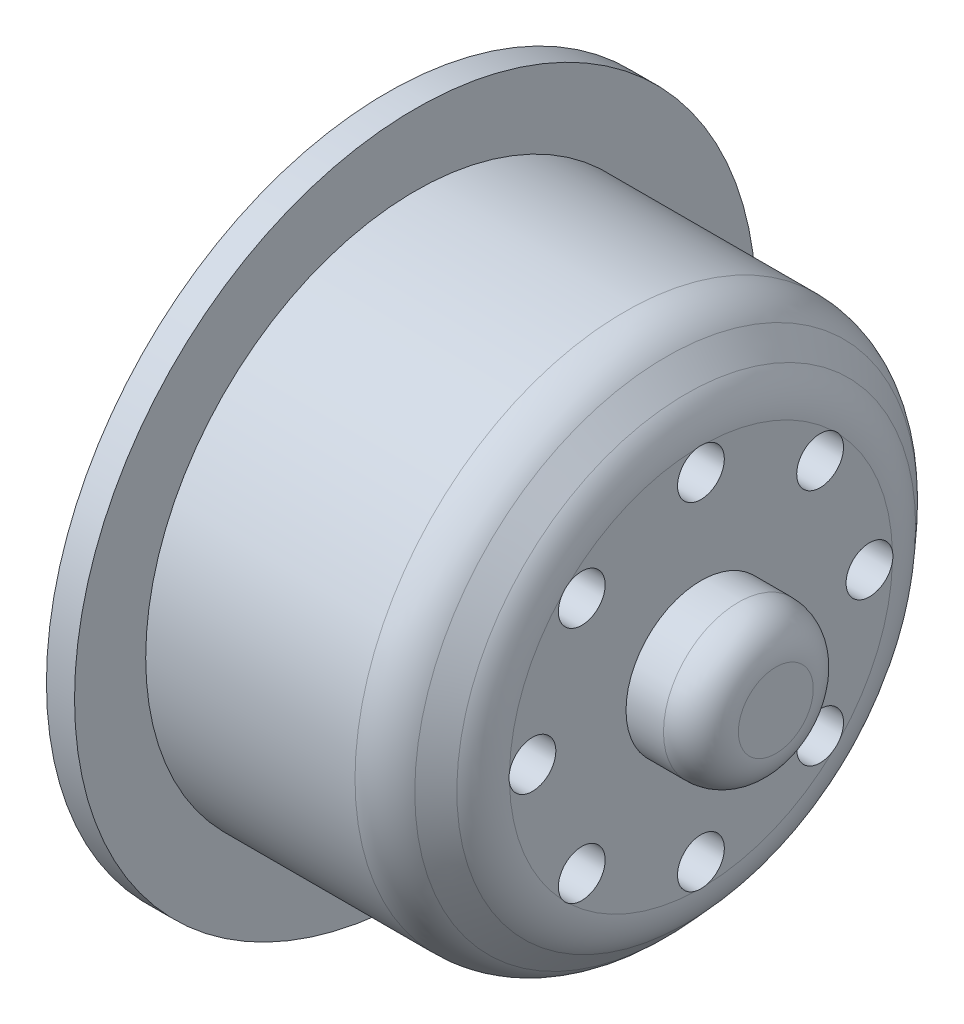
ISO-10303-21;
HEADER;
FILE_DESCRIPTION(('STEP AP214'),'2;1');
FILE_NAME('part.step','',(''),(''),'','','');
FILE_SCHEMA(('AUTOMOTIVE_DESIGN { 1 0 10303 214 1 1 1 1 }'));
ENDSEC;
DATA;
#1=APPLICATION_CONTEXT('core data for automotive mechanical design processes');
#2=APPLICATION_PROTOCOL_DEFINITION('international standard','automotive_design',2000,#1);
#3=PRODUCT_CONTEXT('',#1,'mechanical');
#4=PRODUCT('Part','Part','',(#3));
#5=PRODUCT_RELATED_PRODUCT_CATEGORY('part','',(#4));
#6=PRODUCT_DEFINITION_FORMATION('','',#4);
#7=PRODUCT_DEFINITION_CONTEXT('part definition',#1,'design');
#8=PRODUCT_DEFINITION('design','',#6,#7);
#9=PRODUCT_DEFINITION_SHAPE('','',#8);
#10=(LENGTH_UNIT() NAMED_UNIT(*) SI_UNIT(.MILLI.,.METRE.));
#11=(NAMED_UNIT(*) PLANE_ANGLE_UNIT() SI_UNIT($,.RADIAN.));
#12=(NAMED_UNIT(*) SI_UNIT($,.STERADIAN.) SOLID_ANGLE_UNIT());
#13=UNCERTAINTY_MEASURE_WITH_UNIT(LENGTH_MEASURE(1.E-05),#10,'distance_accuracy_value','');
#14=(GEOMETRIC_REPRESENTATION_CONTEXT(3) GLOBAL_UNCERTAINTY_ASSIGNED_CONTEXT((#13)) GLOBAL_UNIT_ASSIGNED_CONTEXT((#10,
#11,#12)) REPRESENTATION_CONTEXT('',''));
#15=CARTESIAN_POINT('',(0.,0.,0.));
#16=DIRECTION('',(0.,0.,1.));
#17=DIRECTION('',(1.,0.,0.));
#18=AXIS2_PLACEMENT_3D('',#15,#16,#17);
#19=CARTESIAN_POINT('',(-9.66596868854574,6.36396103067838,6.3639610306787));
#20=DIRECTION('',(1.,0.,0.));
#21=DIRECTION('',(0.,0.,-1.));
#22=AXIS2_PLACEMENT_3D('',#19,#20,#21);
#23=CYLINDRICAL_SURFACE('',#22,1.25000000000048);
#24=CARTESIAN_POINT('',(10.6195652173913,6.36396103067838,6.3639610306787));
#25=DIRECTION('',(1.,0.,0.));
#26=DIRECTION('',(0.,0.,-1.));
#27=AXIS2_PLACEMENT_3D('',#24,#25,#26);
#28=CIRCLE('',#27,1.25000000000048);
#29=CARTESIAN_POINT('',(10.6195652173913,7.04596741641522,7.41151403163636));
#30=VERTEX_POINT('',#29);
#31=CARTESIAN_POINT('',(10.6195652173913,7.411514031636,7.04596741641559));
#32=VERTEX_POINT('',#31);
#33=EDGE_CURVE('E147',#30,#32,#28,.T.);
#34=ORIENTED_EDGE('',*,*,#33,.T.);
#35=CARTESIAN_POINT('',(10.6195652173913,7.411514031636,7.04596741641559));
#36=CARTESIAN_POINT('',(10.6195631780049,7.3921665441352,7.07568123261779));
#37=CARTESIAN_POINT('',(10.6195450792208,7.37156780283131,7.10455609710923));
#38=CARTESIAN_POINT('',(10.6195060472776,7.32798836855858,7.16046028078622));
#39=CARTESIAN_POINT('',(10.6194851133993,7.30500707156565,7.18748912907579));
#40=CARTESIAN_POINT('',(10.6194623135887,7.23356505711365,7.26458438701048));
#41=CARTESIAN_POINT('',(10.6194982553825,7.18188988291681,7.31175467629777));
#42=CARTESIAN_POINT('',(10.6195444906783,7.10055561788832,7.37442318921318));
#43=CARTESIAN_POINT('',(10.6195583321452,7.07361016905411,7.3935317962861));
#44=CARTESIAN_POINT('',(10.6195652173913,7.04596741641522,7.41151403163636));
#45=B_SPLINE_CURVE_WITH_KNOTS('',3,(#35,#36,#37,#38,#39,#40,#41,#42,#43,#44),.UNSPECIFIED.,.F.,
.F.,(4,2,2,2,4),(0.,0.106299940745221,0.212626896795299,0.421403751994226,0.520384501001311),.UNSPECIFIED.);
#46=EDGE_CURVE('E53',#32,#30,#45,.T.);
#47=ORIENTED_EDGE('',*,*,#46,.T.);
#48=EDGE_LOOP('',(#34,#47));
#49=FACE_BOUND('',#48,.T.);
#50=CARTESIAN_POINT('',(5.61956521739131,6.36396103067838,6.3639610306787));
#51=DIRECTION('',(-1.,0.,0.));
#52=DIRECTION('',(0.,0.,1.));
#53=AXIS2_PLACEMENT_3D('',#50,#51,#52);
#54=CIRCLE('',#53,1.25000000000048);
#55=CARTESIAN_POINT('',(5.61956521739131,6.36396103067838,7.61396103067918));
#56=VERTEX_POINT('',#55);
#57=EDGE_CURVE('E149',#56,#56,#54,.F.);
#58=ORIENTED_EDGE('',*,*,#57,.F.);
#59=EDGE_LOOP('',(#58));
#60=FACE_BOUND('',#59,.T.);
#61=ADVANCED_FACE('F39',(#49,#60),#23,.F.);
#62=CARTESIAN_POINT('',(-9.66596868854574,-7.66835063561292E-13,8.99999999999923));
#63=DIRECTION('',(1.,0.,0.));
#64=DIRECTION('',(0.,0.,-1.));
#65=AXIS2_PLACEMENT_3D('',#62,#63,#64);
#66=CYLINDRICAL_SURFACE('',#65,1.25000000000105);
#67=CARTESIAN_POINT('',(10.6195652173913,-7.66835063561292E-13,8.99999999999923));
#68=DIRECTION('',(1.,0.,0.));
#69=DIRECTION('',(0.,0.,-1.));
#70=AXIS2_PLACEMENT_3D('',#67,#68,#69);
#71=CIRCLE('',#70,1.25000000000105);
#72=CARTESIAN_POINT('',(10.6195652173913,-0.258480490465189,10.2229831707959));
#73=VERTEX_POINT('',#72);
#74=CARTESIAN_POINT('',(10.6195652173913,0.258480490463447,10.222983170796));
#75=VERTEX_POINT('',#74);
#76=EDGE_CURVE('E144',#73,#75,#71,.T.);
#77=ORIENTED_EDGE('',*,*,#76,.T.);
#78=CARTESIAN_POINT('',(10.6195652173913,0.258480490463447,10.222983170796));
#79=CARTESIAN_POINT('',(10.6195631780049,0.223788909921195,10.2303132721168));
#80=CARTESIAN_POINT('',(10.6195450792208,0.188805787773558,10.2361653749447));
#81=CARTESIAN_POINT('',(10.6195060472776,0.118460246904311,10.244880288825));
#82=CARTESIAN_POINT('',(10.6194851133993,0.0830977340469196,10.2477423397941));
#83=CARTESIAN_POINT('',(10.6194623135887,-0.021933978516702,10.2517397865965));
#84=CARTESIAN_POINT('',(10.6194982553825,-0.0918282760358895,10.2485543519286));
#85=CARTESIAN_POINT('',(10.6195444906783,-0.193653616830998,10.2353556720335));
#86=CARTESIAN_POINT('',(10.6195583321452,-0.226218752065304,10.2298141880808));
#87=CARTESIAN_POINT('',(10.6195652173913,-0.258480490465189,10.2229831707959));
#88=B_SPLINE_CURVE_WITH_KNOTS('',3,(#78,#79,#80,#81,#82,#83,#84,#85,#86,#87),.UNSPECIFIED.,.F.,
.F.,(4,2,2,2,4),(0.,0.106299940745276,0.212626896795408,0.421403751994417,0.520384501005222),.UNSPECIFIED.);
#89=EDGE_CURVE('E285',#75,#73,#88,.T.);
#90=ORIENTED_EDGE('',*,*,#89,.T.);
#91=EDGE_LOOP('',(#77,#90));
#92=FACE_BOUND('',#91,.T.);
#93=CARTESIAN_POINT('',(5.61956521739131,-7.66835063561292E-13,8.99999999999923));
#94=DIRECTION('',(-1.,0.,0.));
#95=DIRECTION('',(0.,0.,1.));
#96=AXIS2_PLACEMENT_3D('',#93,#94,#95);
#97=CIRCLE('',#96,1.25000000000105);
#98=CARTESIAN_POINT('',(5.61956521739131,-7.66835063561292E-13,10.2500000000003));
#99=VERTEX_POINT('',#98);
#100=EDGE_CURVE('E189',#99,#99,#97,.F.);
#101=ORIENTED_EDGE('',*,*,#100,.F.);
#102=EDGE_LOOP('',(#101));
#103=FACE_BOUND('',#102,.T.);
#104=ADVANCED_FACE('F277',(#92,#103),#66,.F.);
#105=CARTESIAN_POINT('',(-9.66596868854574,-6.36396103067947,6.36396103067762));
#106=DIRECTION('',(1.,0.,0.));
#107=DIRECTION('',(0.,0.,-1.));
#108=AXIS2_PLACEMENT_3D('',#105,#106,#107);
#109=CYLINDRICAL_SURFACE('',#108,1.25000000000148);
#110=CARTESIAN_POINT('',(10.6195652173913,-6.36396103067947,6.36396103067762));
#111=DIRECTION('',(1.,0.,0.));
#112=DIRECTION('',(0.,0.,-1.));
#113=AXIS2_PLACEMENT_3D('',#110,#111,#112);
#114=CIRCLE('',#113,1.25000000000148);
#115=CARTESIAN_POINT('',(10.6195652173913,-7.41151403164101,7.04596741641032));
#116=VERTEX_POINT('',#115);
#117=CARTESIAN_POINT('',(10.6195652173913,-7.04596741641248,7.41151403163896));
#118=VERTEX_POINT('',#117);
#119=EDGE_CURVE('E141',#116,#118,#114,.T.);
#120=ORIENTED_EDGE('',*,*,#119,.T.);
#121=CARTESIAN_POINT('',(10.6195652173913,-7.04596741641248,7.41151403163896));
#122=CARTESIAN_POINT('',(10.6195631780049,-7.07568123261479,7.39216654413827));
#123=CARTESIAN_POINT('',(10.6195450792208,-7.10455609710634,7.37156780283448));
#124=CARTESIAN_POINT('',(10.6195060472776,-7.16046028078358,7.32798836856194));
#125=CARTESIAN_POINT('',(10.6194851133993,-7.18748912907327,7.3050070715691));
#126=CARTESIAN_POINT('',(10.6194623135887,-7.26458438700831,7.23356505711737));
#127=CARTESIAN_POINT('',(10.6194982553825,-7.31175467629584,7.1818898829207));
#128=CARTESIAN_POINT('',(10.6195444906783,-7.37442318921385,7.10055561788955));
#129=CARTESIAN_POINT('',(10.6195583321452,-7.39353179628889,7.07361016905235));
#130=CARTESIAN_POINT('',(10.6195652173913,-7.41151403164101,7.04596741641032));
#131=B_SPLINE_CURVE_WITH_KNOTS('',3,(#121,#122,#123,#124,#125,#126,#127,#128,#129,#130),
.UNSPECIFIED.,.F.,.F.,(4,2,2,2,4),(0.,0.106299940745328,0.212626896795508,0.421403751994564,
0.520384501012581),.UNSPECIFIED.);
#132=EDGE_CURVE('E280',#118,#116,#131,.T.);
#133=ORIENTED_EDGE('',*,*,#132,.T.);
#134=EDGE_LOOP('',(#120,#133));
#135=FACE_BOUND('',#134,.T.);
#136=CARTESIAN_POINT('',(5.61956521739131,-6.36396103067947,6.36396103067762));
#137=DIRECTION('',(-1.,0.,0.));
#138=DIRECTION('',(0.,0.,1.));
#139=AXIS2_PLACEMENT_3D('',#136,#137,#138);
#140=CIRCLE('',#139,1.25000000000148);
#141=CARTESIAN_POINT('',(5.61956521739131,-6.36396103067947,7.6139610306791));
#142=VERTEX_POINT('',#141);
#143=EDGE_CURVE('E186',#142,#142,#140,.F.);
#144=ORIENTED_EDGE('',*,*,#143,.F.);
#145=EDGE_LOOP('',(#144));
#146=FACE_BOUND('',#145,.T.);
#147=ADVANCED_FACE('F272',(#135,#146),#109,.F.);
#148=CARTESIAN_POINT('',(-9.66596868854574,-9.,-1.53146576288412E-12));
#149=DIRECTION('',(1.,0.,0.));
#150=DIRECTION('',(0.,0.,-1.));
#151=AXIS2_PLACEMENT_3D('',#148,#149,#150);
#152=CYLINDRICAL_SURFACE('',#151,1.25000000000152);
#153=CARTESIAN_POINT('',(10.6195652173913,-9.,-1.53146576288412E-12));
#154=DIRECTION('',(1.,0.,0.));
#155=DIRECTION('',(0.,0.,-1.));
#156=AXIS2_PLACEMENT_3D('',#153,#154,#155);
#157=CIRCLE('',#156,1.25000000000152);
#158=CARTESIAN_POINT('',(10.6195652173913,-10.2229831707957,-0.258480490472793));
#159=VERTEX_POINT('',#158);
#160=CARTESIAN_POINT('',(10.6195652173913,-10.2229831707958,0.258480490469314));
#161=VERTEX_POINT('',#160);
#162=EDGE_CURVE('E138',#159,#161,#157,.T.);
#163=ORIENTED_EDGE('',*,*,#162,.T.);
#164=CARTESIAN_POINT('',(10.6195652173913,-10.2229831707958,0.258480490469314));
#165=CARTESIAN_POINT('',(10.6195631780049,-10.2303132721168,0.223788909927081));
#166=CARTESIAN_POINT('',(10.6195450792208,-10.2361653749449,0.188805787779453));
#167=CARTESIAN_POINT('',(10.6195060472776,-10.2448802888256,0.118460246910208));
#168=CARTESIAN_POINT('',(10.6194851133993,-10.2477423397949,0.0830977340528114));
#169=CARTESIAN_POINT('',(10.6194623135887,-10.2517397865979,-0.0219339785108185));
#170=CARTESIAN_POINT('',(10.6194982553825,-10.2485543519303,-0.0918282760300287));
#171=CARTESIAN_POINT('',(10.6195444906783,-10.2353556720352,-0.193653616829725));
#172=CARTESIAN_POINT('',(10.6195583321452,-10.2298141880817,-0.226218752068514));
#173=CARTESIAN_POINT('',(10.6195652173913,-10.2229831707957,-0.258480490472793));
#174=B_SPLINE_CURVE_WITH_KNOTS('',3,(#164,#165,#166,#167,#168,#169,#170,#171,#172,#173),
.UNSPECIFIED.,.F.,.F.,(4,2,2,2,4),(0.,0.106299940745344,0.212626896795537,0.421403751994579,
0.520384501018977),.UNSPECIFIED.);
#175=EDGE_CURVE('E257',#161,#159,#174,.T.);
#176=ORIENTED_EDGE('',*,*,#175,.T.);
#177=EDGE_LOOP('',(#163,#176));
#178=FACE_BOUND('',#177,.T.);
#179=CARTESIAN_POINT('',(5.61956521739131,-9.,-1.53146576288412E-12));
#180=DIRECTION('',(-1.,0.,0.));
#181=DIRECTION('',(0.,0.,1.));
#182=AXIS2_PLACEMENT_3D('',#179,#180,#181);
#183=CIRCLE('',#182,1.25000000000152);
#184=CARTESIAN_POINT('',(5.61956521739131,-9.,1.24999999999999));
#185=VERTEX_POINT('',#184);
#186=EDGE_CURVE('E183',#185,#185,#183,.F.);
#187=ORIENTED_EDGE('',*,*,#186,.F.);
#188=EDGE_LOOP('',(#187));
#189=FACE_BOUND('',#188,.T.);
#190=ADVANCED_FACE('F267',(#178,#189),#152,.F.);
#191=CARTESIAN_POINT('',(-9.66596868854574,-6.36396103067839,-6.36396103068023));
#192=DIRECTION('',(1.,0.,0.));
#193=DIRECTION('',(0.,0.,-1.));
#194=AXIS2_PLACEMENT_3D('',#191,#192,#193);
#195=CYLINDRICAL_SURFACE('',#194,1.25000000000114);
#196=CARTESIAN_POINT('',(10.6195652173913,-6.36396103067839,-6.36396103068023));
#197=DIRECTION('',(1.,0.,0.));
#198=DIRECTION('',(0.,0.,-1.));
#199=AXIS2_PLACEMENT_3D('',#196,#197,#198);
#200=CIRCLE('',#199,1.25000000000114);
#201=CARTESIAN_POINT('',(10.6195652173913,-7.04596741640749,-7.4115140316437));
#202=VERTEX_POINT('',#201);
#203=CARTESIAN_POINT('',(10.6195652173913,-7.41151403164166,-7.04596741640964));
#204=VERTEX_POINT('',#203);
#205=EDGE_CURVE('E135',#202,#204,#200,.T.);
#206=ORIENTED_EDGE('',*,*,#205,.T.);
#207=CARTESIAN_POINT('',(10.6195652173913,-7.41151403164166,-7.04596741640964));
#208=CARTESIAN_POINT('',(10.6195631780049,-7.39216654414107,-7.07568123261201));
#209=CARTESIAN_POINT('',(10.6195450792208,-7.37156780283737,-7.10455609710363));
#210=CARTESIAN_POINT('',(10.6195060472776,-7.32798836856502,-7.160460280781));
#211=CARTESIAN_POINT('',(10.6194851133993,-7.30500707157227,-7.18748912907076));
#212=CARTESIAN_POINT('',(10.6194623135887,-7.23356505712082,-7.26458438700601));
#213=CARTESIAN_POINT('',(10.6194982553825,-7.18188988292432,-7.31175467629368));
#214=CARTESIAN_POINT('',(10.6195444906783,-7.10055561789125,-7.3744231892136));
#215=CARTESIAN_POINT('',(10.6195583321452,-7.07361016905184,-7.3935317962902));
#216=CARTESIAN_POINT('',(10.6195652173913,-7.04596741640749,-7.4115140316437));
#217=B_SPLINE_CURVE_WITH_KNOTS('',3,(#207,#208,#209,#210,#211,#212,#213,#214,#215,#216),
.UNSPECIFIED.,.F.,.F.,(4,2,2,2,4),(0.,0.106299940745316,0.212626896795477,0.421403751994447,
0.520384501020571),.UNSPECIFIED.);
#218=EDGE_CURVE('E251',#204,#202,#217,.T.);
#219=ORIENTED_EDGE('',*,*,#218,.T.);
#220=EDGE_LOOP('',(#206,#219));
#221=FACE_BOUND('',#220,.T.);
#222=CARTESIAN_POINT('',(5.61956521739131,-6.36396103067839,-6.36396103068023));
#223=DIRECTION('',(-1.,0.,0.));
#224=DIRECTION('',(0.,0.,1.));
#225=AXIS2_PLACEMENT_3D('',#222,#223,#224);
#226=CIRCLE('',#225,1.25000000000114);
#227=CARTESIAN_POINT('',(5.61956521739131,-6.36396103067839,-5.1139610306791));
#228=VERTEX_POINT('',#227);
#229=EDGE_CURVE('E180',#228,#228,#226,.F.);
#230=ORIENTED_EDGE('',*,*,#229,.F.);
#231=EDGE_LOOP('',(#230));
#232=FACE_BOUND('',#231,.T.);
#233=ADVANCED_FACE('F264',(#221,#232),#195,.F.);
#234=CARTESIAN_POINT('',(-9.66596868854574,7.65732881442059E-13,-9.00000000000076));
#235=DIRECTION('',(1.,0.,0.));
#236=DIRECTION('',(0.,0.,-1.));
#237=AXIS2_PLACEMENT_3D('',#234,#235,#236);
#238=CYLINDRICAL_SURFACE('',#237,1.25000000000054);
#239=CARTESIAN_POINT('',(10.6195652173913,7.65732881442059E-13,-9.00000000000076));
#240=DIRECTION('',(1.,0.,0.));
#241=DIRECTION('',(0.,0.,-1.));
#242=AXIS2_PLACEMENT_3D('',#239,#240,#241);
#243=CIRCLE('',#242,1.25000000000054);
#244=CARTESIAN_POINT('',(10.6195652173913,0.258480490470619,-10.2229831707958));
#245=VERTEX_POINT('',#244);
#246=CARTESIAN_POINT('',(10.6195652173913,-0.258480490468879,-10.2229831707958));
#247=VERTEX_POINT('',#246);
#248=EDGE_CURVE('E127',#245,#247,#243,.T.);
#249=ORIENTED_EDGE('',*,*,#248,.T.);
#250=CARTESIAN_POINT('',(10.6195652173913,-0.258480490468879,-10.2229831707958));
#251=CARTESIAN_POINT('',(10.6195631780049,-0.223788909926669,-10.2303132721168));
#252=CARTESIAN_POINT('',(10.6195450792208,-0.188805787779065,-10.2361653749449));
#253=CARTESIAN_POINT('',(10.6195060472776,-0.118460246909872,-10.2448802888255));
#254=CARTESIAN_POINT('',(10.6194851133993,-0.0830977340525016,-10.2477423397947));
#255=CARTESIAN_POINT('',(10.6194623135887,0.0219339785110503,-10.2517397865976));
#256=CARTESIAN_POINT('',(10.6194982553825,0.0918282760302062,-10.24855435193));
#257=CARTESIAN_POINT('',(10.6195444906783,0.193653616829069,-10.2353556720349));
#258=CARTESIAN_POINT('',(10.6195583321452,0.226218752067091,-10.2298141880816));
#259=CARTESIAN_POINT('',(10.6195652173913,0.258480490470619,-10.2229831707958));
#260=B_SPLINE_CURVE_WITH_KNOTS('',3,(#250,#251,#252,#253,#254,#255,#256,#257,#258,#259),
.UNSPECIFIED.,.F.,.F.,(4,2,2,2,4),(0.,0.106299940745255,0.212626896795361,0.421403751994246,
0.520384501016319),.UNSPECIFIED.);
#261=EDGE_CURVE('E245',#247,#245,#260,.T.);
#262=ORIENTED_EDGE('',*,*,#261,.T.);
#263=EDGE_LOOP('',(#249,#262));
#264=FACE_BOUND('',#263,.T.);
#265=CARTESIAN_POINT('',(5.61956521739131,7.65732881442059E-13,-9.00000000000076));
#266=DIRECTION('',(-1.,0.,0.));
#267=DIRECTION('',(0.,0.,1.));
#268=AXIS2_PLACEMENT_3D('',#265,#266,#267);
#269=CIRCLE('',#268,1.25000000000054);
#270=CARTESIAN_POINT('',(5.61956521739131,7.65732881442059E-13,-7.75000000000023));
#271=VERTEX_POINT('',#270);
#272=EDGE_CURVE('E177',#271,#271,#269,.F.);
#273=ORIENTED_EDGE('',*,*,#272,.F.);
#274=EDGE_LOOP('',(#273));
#275=FACE_BOUND('',#274,.T.);
#276=ADVANCED_FACE('F236',(#264,#275),#238,.F.);
#277=CARTESIAN_POINT('',(-9.66596868854574,6.36396103067947,-6.36396103067915));
#278=DIRECTION('',(1.,0.,0.));
#279=DIRECTION('',(0.,0.,-1.));
#280=AXIS2_PLACEMENT_3D('',#277,#278,#279);
#281=CYLINDRICAL_SURFACE('',#280,1.25000000000007);
#282=CARTESIAN_POINT('',(10.6195652173913,6.36396103067947,-6.36396103067915));
#283=DIRECTION('',(1.,0.,0.));
#284=DIRECTION('',(0.,0.,-1.));
#285=AXIS2_PLACEMENT_3D('',#282,#283,#284);
#286=CIRCLE('',#285,1.25000000000007);
#287=CARTESIAN_POINT('',(10.6195652173913,7.41151403163883,-7.04596741641262));
#288=VERTEX_POINT('',#287);
#289=CARTESIAN_POINT('',(10.6195652173913,7.04596741641299,-7.41151403163847));
#290=VERTEX_POINT('',#289);
#291=EDGE_CURVE('E118',#288,#290,#286,.T.);
#292=ORIENTED_EDGE('',*,*,#291,.T.);
#293=CARTESIAN_POINT('',(10.6195652173913,7.04596741641299,-7.41151403163847));
#294=CARTESIAN_POINT('',(10.6195631780049,7.07568123261524,-7.39216654413777));
#295=CARTESIAN_POINT('',(10.6195450792208,7.10455609710673,-7.37156780283397));
#296=CARTESIAN_POINT('',(10.6195060472776,7.16046028078385,-7.32798836856141));
#297=CARTESIAN_POINT('',(10.6194851133993,7.18748912907348,-7.30500707156857));
#298=CARTESIAN_POINT('',(10.6194623135887,7.26458438700835,-7.23356505711683));
#299=CARTESIAN_POINT('',(10.6194982553825,7.31175467629577,-7.18188988292015));
#300=CARTESIAN_POINT('',(10.6195444906783,7.37442318921293,-7.1005556178899));
#301=CARTESIAN_POINT('',(10.6195583321452,7.3935317962873,-7.07361016905365));
#302=CARTESIAN_POINT('',(10.6195652173913,7.41151403163883,-7.04596741641262));
#303=B_SPLINE_CURVE_WITH_KNOTS('',3,(#293,#294,#295,#296,#297,#298,#299,#300,#301,#302),
.UNSPECIFIED.,.F.,.F.,(4,2,2,2,4),(0.,0.106299940745201,0.212626896795256,0.421403751994088,
0.520384501008637),.UNSPECIFIED.);
#304=EDGE_CURVE('E47',#290,#288,#303,.T.);
#305=ORIENTED_EDGE('',*,*,#304,.T.);
#306=EDGE_LOOP('',(#292,#305));
#307=FACE_BOUND('',#306,.T.);
#308=CARTESIAN_POINT('',(5.61956521739131,6.36396103067947,-6.36396103067915));
#309=DIRECTION('',(-1.,0.,0.));
#310=DIRECTION('',(0.,0.,1.));
#311=AXIS2_PLACEMENT_3D('',#308,#309,#310);
#312=CIRCLE('',#311,1.25000000000007);
#313=CARTESIAN_POINT('',(5.61956521739131,6.36396103067947,-5.11396103067908));
#314=VERTEX_POINT('',#313);
#315=EDGE_CURVE('E174',#314,#314,#312,.F.);
#316=ORIENTED_EDGE('',*,*,#315,.F.);
#317=EDGE_LOOP('',(#316));
#318=FACE_BOUND('',#317,.T.);
#319=ADVANCED_FACE('F230',(#307,#318),#281,.F.);
#320=CARTESIAN_POINT('',(-9.66596868854574,9.,0.));
#321=DIRECTION('',(1.,0.,0.));
#322=DIRECTION('',(0.,0.,-1.));
#323=AXIS2_PLACEMENT_3D('',#320,#321,#322);
#324=CYLINDRICAL_SURFACE('',#323,1.25);
#325=CARTESIAN_POINT('',(10.6195652173913,9.,0.));
#326=DIRECTION('',(1.,0.,0.));
#327=DIRECTION('',(0.,0.,-1.));
#328=AXIS2_PLACEMENT_3D('',#325,#326,#327);
#329=CIRCLE('',#328,1.25);
#330=CARTESIAN_POINT('',(10.6195652173913,10.222983170796,0.258480490462679));
#331=VERTEX_POINT('',#330);
#332=CARTESIAN_POINT('',(10.6195652173913,10.222983170796,-0.258480490462679));
#333=VERTEX_POINT('',#332);
#334=EDGE_CURVE('E116',#331,#333,#329,.T.);
#335=ORIENTED_EDGE('',*,*,#334,.T.);
#336=CARTESIAN_POINT('',(10.6195652173913,10.222983170796,-0.258480490462679));
#337=CARTESIAN_POINT('',(10.6195631780049,10.2303132721168,-0.223788909920451));
#338=CARTESIAN_POINT('',(10.6195450792208,10.2361653749446,-0.188805787772839));
#339=CARTESIAN_POINT('',(10.6195060472776,10.2448802888248,-0.118460246903644));
#340=CARTESIAN_POINT('',(10.6194851133993,10.2477423397939,-0.083097734046281));
#341=CARTESIAN_POINT('',(10.6194623135887,10.2517397865962,0.0219339785172594));
#342=CARTESIAN_POINT('',(10.6194982553825,10.2485543519282,0.0918282760363895));
#343=CARTESIAN_POINT('',(10.6195444906783,10.2353556720331,0.193653616830439));
#344=CARTESIAN_POINT('',(10.6195583321452,10.2298141880806,0.22621875206376));
#345=CARTESIAN_POINT('',(10.6195652173913,10.222983170796,0.258480490462679));
#346=B_SPLINE_CURVE_WITH_KNOTS('',3,(#336,#337,#338,#339,#340,#341,#342,#343,#344,#345),
.UNSPECIFIED.,.F.,.F.,(4,2,2,2,4),(0.,0.106299940745182,0.21262689679522,0.421403751994065,
0.520384501001881),.UNSPECIFIED.);
#347=EDGE_CURVE('E104',#333,#331,#346,.T.);
#348=ORIENTED_EDGE('',*,*,#347,.T.);
#349=EDGE_LOOP('',(#335,#348));
#350=FACE_BOUND('',#349,.T.);
#351=CARTESIAN_POINT('',(5.61956521739131,9.,0.));
#352=DIRECTION('',(-1.,0.,0.));
#353=DIRECTION('',(0.,0.,1.));
#354=AXIS2_PLACEMENT_3D('',#351,#352,#353);
#355=CIRCLE('',#354,1.25);
#356=CARTESIAN_POINT('',(5.61956521739131,9.,1.25));
#357=VERTEX_POINT('',#356);
#358=EDGE_CURVE('E171',#357,#357,#355,.F.);
#359=ORIENTED_EDGE('',*,*,#358,.F.);
#360=EDGE_LOOP('',(#359));
#361=FACE_BOUND('',#360,.T.);
#362=ADVANCED_FACE('F120',(#350,#361),#324,.F.);
#363=CARTESIAN_POINT('',(-4.6304347826087,0.,-14.4));
#364=DIRECTION('',(-1.,0.,0.));
#365=DIRECTION('',(0.,0.,1.));
#366=AXIS2_PLACEMENT_3D('',#363,#364,#365);
#367=PLANE('',#366);
#368=CARTESIAN_POINT('',(-4.6304347826087,0.,0.));
#369=DIRECTION('',(-1.,0.,0.));
#370=DIRECTION('',(0.,0.,1.));
#371=AXIS2_PLACEMENT_3D('',#368,#369,#370);
#372=CIRCLE('',#371,18.2);
#373=CARTESIAN_POINT('',(-4.6304347826087,0.,18.2));
#374=VERTEX_POINT('',#373);
#375=EDGE_CURVE('E161',#374,#374,#372,.T.);
#376=ORIENTED_EDGE('',*,*,#375,.F.);
#377=EDGE_LOOP('',(#376));
#378=FACE_BOUND('',#377,.T.);
#379=CARTESIAN_POINT('',(-4.6304347826087,0.,0.));
#380=DIRECTION('',(-1.,0.,0.));
#381=DIRECTION('',(0.,0.,1.));
#382=AXIS2_PLACEMENT_3D('',#379,#380,#381);
#383=CIRCLE('',#382,14.4);
#384=CARTESIAN_POINT('',(-4.6304347826087,0.,14.4));
#385=VERTEX_POINT('',#384);
#386=EDGE_CURVE('E151',#385,#385,#383,.T.);
#387=ORIENTED_EDGE('',*,*,#386,.T.);
#388=EDGE_LOOP('',(#387));
#389=FACE_BOUND('',#388,.T.);
#390=ADVANCED_FACE('F229',(#378,#389),#367,.F.);
#391=CARTESIAN_POINT('',(-12.3913043478261,0.,0.));
#392=DIRECTION('',(-1.,0.,0.));
#393=DIRECTION('',(0.,0.,1.));
#394=AXIS2_PLACEMENT_3D('',#391,#392,#393);
#395=CYLINDRICAL_SURFACE('',#394,18.2);
#396=CARTESIAN_POINT('',(-6.1304347826087,0.,0.));
#397=DIRECTION('',(-1.,0.,0.));
#398=DIRECTION('',(0.,0.,1.));
#399=AXIS2_PLACEMENT_3D('',#396,#397,#398);
#400=CIRCLE('',#399,18.2);
#401=CARTESIAN_POINT('',(-6.1304347826087,0.,18.2));
#402=VERTEX_POINT('',#401);
#403=EDGE_CURVE('E158',#402,#402,#400,.T.);
#404=ORIENTED_EDGE('',*,*,#403,.F.);
#405=EDGE_LOOP('',(#404));
#406=FACE_BOUND('',#405,.T.);
#407=ORIENTED_EDGE('',*,*,#375,.T.);
#408=EDGE_LOOP('',(#407));
#409=FACE_BOUND('',#408,.T.);
#410=ADVANCED_FACE('F366',(#406,#409),#395,.T.);
#411=CARTESIAN_POINT('',(-6.13043478260869,0.,-18.2));
#412=DIRECTION('',(1.,0.,0.));
#413=DIRECTION('',(0.,0.,-1.));
#414=AXIS2_PLACEMENT_3D('',#411,#412,#413);
#415=PLANE('',#414);
#416=CARTESIAN_POINT('',(-6.13043478260869,6.36396103067784,-6.36396103067848));
#417=DIRECTION('',(-1.,0.,0.));
#418=DIRECTION('',(0.,0.,1.));
#419=AXIS2_PLACEMENT_3D('',#416,#417,#418);
#420=CIRCLE('',#419,2.50000000000085);
#421=CARTESIAN_POINT('',(-6.13043478260869,6.36396103067784,-3.86396103067763));
#422=VERTEX_POINT('',#421);
#423=EDGE_CURVE('E707',#422,#422,#420,.T.);
#424=ORIENTED_EDGE('',*,*,#423,.F.);
#425=EDGE_LOOP('',(#424));
#426=FACE_BOUND('',#425,.T.);
#427=CARTESIAN_POINT('',(-6.13043478260869,-1.5342212181822E-12,-8.99999999999847));
#428=DIRECTION('',(-1.,0.,0.));
#429=DIRECTION('',(0.,0.,1.));
#430=AXIS2_PLACEMENT_3D('',#427,#428,#429);
#431=CIRCLE('',#430,2.50000000000201);
#432=CARTESIAN_POINT('',(-6.13043478260869,-1.5342212181822E-12,-6.49999999999646));
#433=VERTEX_POINT('',#432);
#434=EDGE_CURVE('E701',#433,#433,#431,.T.);
#435=ORIENTED_EDGE('',*,*,#434,.F.);
#436=EDGE_LOOP('',(#435));
#437=FACE_BOUND('',#436,.T.);
#438=CARTESIAN_POINT('',(-6.13043478260869,-6.36396103068001,-6.36396103067631));
#439=DIRECTION('',(-1.,0.,0.));
#440=DIRECTION('',(0.,0.,1.));
#441=AXIS2_PLACEMENT_3D('',#438,#439,#440);
#442=CIRCLE('',#441,2.5000000000029);
#443=CARTESIAN_POINT('',(-6.13043478260869,-6.36396103068001,-3.86396103067342));
#444=VERTEX_POINT('',#443);
#445=EDGE_CURVE('E695',#444,#444,#442,.T.);
#446=ORIENTED_EDGE('',*,*,#445,.F.);
#447=EDGE_LOOP('',(#446));
#448=FACE_BOUND('',#447,.T.);
#449=CARTESIAN_POINT('',(-6.13043478260869,-9.,3.06623807212593E-12));
#450=DIRECTION('',(-1.,0.,0.));
#451=DIRECTION('',(0.,0.,1.));
#452=AXIS2_PLACEMENT_3D('',#449,#450,#451);
#453=CIRCLE('',#452,2.50000000000299);
#454=CARTESIAN_POINT('',(-6.13043478260869,-9.,2.50000000000606));
#455=VERTEX_POINT('',#454);
#456=EDGE_CURVE('E689',#455,#455,#453,.T.);
#457=ORIENTED_EDGE('',*,*,#456,.F.);
#458=EDGE_LOOP('',(#457));
#459=FACE_BOUND('',#458,.T.);
#460=CARTESIAN_POINT('',(-6.13043478260869,-6.36396103067784,6.36396103068154));
#461=DIRECTION('',(-1.,0.,0.));
#462=DIRECTION('',(0.,0.,1.));
#463=AXIS2_PLACEMENT_3D('',#460,#461,#462);
#464=CIRCLE('',#463,2.50000000000223);
#465=CARTESIAN_POINT('',(-6.13043478260869,-6.36396103067784,8.86396103068378));
#466=VERTEX_POINT('',#465);
#467=EDGE_CURVE('E683',#466,#466,#464,.T.);
#468=ORIENTED_EDGE('',*,*,#467,.F.);
#469=EDGE_LOOP('',(#468));
#470=FACE_BOUND('',#469,.T.);
#471=CARTESIAN_POINT('',(-6.13043478260869,1.53311903606297E-12,9.00000000000153));
#472=DIRECTION('',(-1.,0.,0.));
#473=DIRECTION('',(0.,0.,1.));
#474=AXIS2_PLACEMENT_3D('',#471,#472,#473);
#475=CIRCLE('',#474,2.50000000000105);
#476=CARTESIAN_POINT('',(-6.13043478260869,1.53311903606297E-12,11.5000000000026));
#477=VERTEX_POINT('',#476);
#478=EDGE_CURVE('E677',#477,#477,#475,.T.);
#479=ORIENTED_EDGE('',*,*,#478,.F.);
#480=EDGE_LOOP('',(#479));
#481=FACE_BOUND('',#480,.T.);
#482=CARTESIAN_POINT('',(-6.13043478260869,6.36396103068001,6.36396103067938));
#483=DIRECTION('',(-1.,0.,0.));
#484=DIRECTION('',(0.,0.,1.));
#485=AXIS2_PLACEMENT_3D('',#482,#483,#484);
#486=CIRCLE('',#485,2.50000000000013);
#487=CARTESIAN_POINT('',(-6.13043478260869,6.36396103068001,8.8639610306795));
#488=VERTEX_POINT('',#487);
#489=EDGE_CURVE('E670',#488,#488,#486,.T.);
#490=ORIENTED_EDGE('',*,*,#489,.F.);
#491=EDGE_LOOP('',(#490));
#492=FACE_BOUND('',#491,.T.);
#493=CARTESIAN_POINT('',(-6.13043478260869,9.,0.));
#494=DIRECTION('',(-1.,0.,0.));
#495=DIRECTION('',(0.,0.,1.));
#496=AXIS2_PLACEMENT_3D('',#493,#494,#495);
#497=CIRCLE('',#496,2.5);
#498=CARTESIAN_POINT('',(-6.13043478260869,9.,2.5));
#499=VERTEX_POINT('',#498);
#500=EDGE_CURVE('E674',#499,#499,#497,.T.);
#501=ORIENTED_EDGE('',*,*,#500,.F.);
#502=EDGE_LOOP('',(#501));
#503=FACE_BOUND('',#502,.T.);
#504=CARTESIAN_POINT('',(-6.13043478260869,0.,0.));
#505=DIRECTION('',(-1.,0.,0.));
#506=DIRECTION('',(0.,0.,1.));
#507=AXIS2_PLACEMENT_3D('',#504,#505,#506);
#508=CIRCLE('',#507,5.6);
#509=CARTESIAN_POINT('',(-6.13043478260869,0.,5.6));
#510=VERTEX_POINT('',#509);
#511=EDGE_CURVE('E122',#510,#510,#508,.T.);
#512=ORIENTED_EDGE('',*,*,#511,.F.);
#513=EDGE_LOOP('',(#512));
#514=FACE_BOUND('',#513,.T.);
#515=ORIENTED_EDGE('',*,*,#403,.T.);
#516=EDGE_LOOP('',(#515));
#517=FACE_BOUND('',#516,.T.);
#518=ADVANCED_FACE('F362',(#426,#437,#448,#459,#470,#481,#492,#503,#514,#517),#415,.F.);
#519=CARTESIAN_POINT('',(14.6195652173913,0.,-4.));
#520=DIRECTION('',(-1.,0.,0.));
#521=DIRECTION('',(0.,0.,1.));
#522=AXIS2_PLACEMENT_3D('',#519,#520,#521);
#523=PLANE('',#522);
#524=CARTESIAN_POINT('',(14.6195652173913,0.,0.));
#525=DIRECTION('',(-1.,0.,0.));
#526=DIRECTION('',(0.,0.,1.));
#527=AXIS2_PLACEMENT_3D('',#524,#525,#526);
#528=CIRCLE('',#527,2.);
#529=CARTESIAN_POINT('',(14.6195652173913,0.,2.));
#530=VERTEX_POINT('',#529);
#531=EDGE_CURVE('E167',#530,#530,#528,.F.);
#532=ORIENTED_EDGE('',*,*,#531,.T.);
#533=EDGE_LOOP('',(#532));
#534=FACE_BOUND('',#533,.T.);
#535=ADVANCED_FACE('F358',(#534),#523,.F.);
#536=CARTESIAN_POINT('',(-12.3913043478261,0.,0.));
#537=DIRECTION('',(-1.,0.,0.));
#538=DIRECTION('',(0.,0.,1.));
#539=AXIS2_PLACEMENT_3D('',#536,#537,#538);
#540=CYLINDRICAL_SURFACE('',#539,4.);
#541=CARTESIAN_POINT('',(12.6195652173913,0.,0.));
#542=DIRECTION('',(-1.,0.,0.));
#543=DIRECTION('',(0.,0.,1.));
#544=AXIS2_PLACEMENT_3D('',#541,#542,#543);
#545=CIRCLE('',#544,4.);
#546=CARTESIAN_POINT('',(12.6195652173913,0.,4.));
#547=VERTEX_POINT('',#546);
#548=EDGE_CURVE('E164',#547,#547,#545,.T.);
#549=ORIENTED_EDGE('',*,*,#548,.T.);
#550=EDGE_LOOP('',(#549));
#551=FACE_BOUND('',#550,.T.);
#552=CARTESIAN_POINT('',(10.6195652173913,0.,0.));
#553=DIRECTION('',(-1.,0.,0.));
#554=DIRECTION('',(0.,0.,1.));
#555=AXIS2_PLACEMENT_3D('',#552,#553,#554);
#556=CIRCLE('',#555,4.);
#557=CARTESIAN_POINT('',(10.6195652173913,0.,4.));
#558=VERTEX_POINT('',#557);
#559=EDGE_CURVE('E155',#558,#558,#556,.T.);
#560=ORIENTED_EDGE('',*,*,#559,.F.);
#561=EDGE_LOOP('',(#560));
#562=FACE_BOUND('',#561,.T.);
#563=ADVANCED_FACE('F355',(#551,#562),#540,.T.);
#564=CARTESIAN_POINT('',(10.6195652173913,0.,-11.3904761178154));
#565=DIRECTION('',(-1.,0.,0.));
#566=DIRECTION('',(0.,0.,1.));
#567=AXIS2_PLACEMENT_3D('',#564,#565,#566);
#568=PLANE('',#567);
#569=ORIENTED_EDGE('',*,*,#291,.F.);
#570=CARTESIAN_POINT('',(10.6195652173913,0.,0.));
#571=DIRECTION('',(-1.,0.,0.));
#572=DIRECTION('',(0.,0.,1.));
#573=AXIS2_PLACEMENT_3D('',#570,#571,#572);
#574=CIRCLE('',#573,10.2262503917285);
#575=EDGE_CURVE('E109',#288,#333,#574,.F.);
#576=ORIENTED_EDGE('',*,*,#575,.T.);
#577=ORIENTED_EDGE('',*,*,#334,.F.);
#578=CARTESIAN_POINT('',(10.6195652173913,0.,0.));
#579=DIRECTION('',(-1.,0.,0.));
#580=DIRECTION('',(0.,0.,1.));
#581=AXIS2_PLACEMENT_3D('',#578,#579,#580);
#582=CIRCLE('',#581,10.2262503917285);
#583=EDGE_CURVE('E60',#331,#32,#582,.F.);
#584=ORIENTED_EDGE('',*,*,#583,.T.);
#585=ORIENTED_EDGE('',*,*,#33,.F.);
#586=CARTESIAN_POINT('',(10.6195652173913,0.,0.));
#587=DIRECTION('',(-1.,0.,0.));
#588=DIRECTION('',(0.,0.,1.));
#589=AXIS2_PLACEMENT_3D('',#586,#587,#588);
#590=CIRCLE('',#589,10.2262503917285);
#591=EDGE_CURVE('E209',#30,#75,#590,.F.);
#592=ORIENTED_EDGE('',*,*,#591,.T.);
#593=ORIENTED_EDGE('',*,*,#76,.F.);
#594=CARTESIAN_POINT('',(10.6195652173913,0.,0.));
#595=DIRECTION('',(-1.,0.,0.));
#596=DIRECTION('',(0.,0.,1.));
#597=AXIS2_PLACEMENT_3D('',#594,#595,#596);
#598=CIRCLE('',#597,10.2262503917285);
#599=EDGE_CURVE('E207',#73,#118,#598,.F.);
#600=ORIENTED_EDGE('',*,*,#599,.T.);
#601=ORIENTED_EDGE('',*,*,#119,.F.);
#602=CARTESIAN_POINT('',(10.6195652173913,0.,0.));
#603=DIRECTION('',(-1.,0.,0.));
#604=DIRECTION('',(0.,0.,1.));
#605=AXIS2_PLACEMENT_3D('',#602,#603,#604);
#606=CIRCLE('',#605,10.2262503917285);
#607=EDGE_CURVE('E205',#116,#161,#606,.F.);
#608=ORIENTED_EDGE('',*,*,#607,.T.);
#609=ORIENTED_EDGE('',*,*,#162,.F.);
#610=CARTESIAN_POINT('',(10.6195652173913,0.,0.));
#611=DIRECTION('',(-1.,0.,0.));
#612=DIRECTION('',(0.,0.,1.));
#613=AXIS2_PLACEMENT_3D('',#610,#611,#612);
#614=CIRCLE('',#613,10.2262503917285);
#615=EDGE_CURVE('E203',#159,#204,#614,.F.);
#616=ORIENTED_EDGE('',*,*,#615,.T.);
#617=ORIENTED_EDGE('',*,*,#205,.F.);
#618=CARTESIAN_POINT('',(10.6195652173913,0.,0.));
#619=DIRECTION('',(-1.,0.,0.));
#620=DIRECTION('',(0.,0.,1.));
#621=AXIS2_PLACEMENT_3D('',#618,#619,#620);
#622=CIRCLE('',#621,10.2262503917285);
#623=EDGE_CURVE('E201',#202,#247,#622,.F.);
#624=ORIENTED_EDGE('',*,*,#623,.T.);
#625=ORIENTED_EDGE('',*,*,#248,.F.);
#626=CARTESIAN_POINT('',(10.6195652173913,0.,0.));
#627=DIRECTION('',(-1.,0.,0.));
#628=DIRECTION('',(0.,0.,1.));
#629=AXIS2_PLACEMENT_3D('',#626,#627,#628);
#630=CIRCLE('',#629,10.2262503917285);
#631=EDGE_CURVE('E199',#245,#290,#630,.F.);
#632=ORIENTED_EDGE('',*,*,#631,.T.);
#633=EDGE_LOOP('',(#569,#576,#577,#584,#585,#592,#593,#600,#601,#608,#609,#616,#617,#624,#625,#632));
#634=FACE_BOUND('',#633,.T.);
#635=ORIENTED_EDGE('',*,*,#559,.T.);
#636=EDGE_LOOP('',(#635));
#637=FACE_BOUND('',#636,.T.);
#638=ADVANCED_FACE('F114',(#634,#637),#568,.F.);
#639=CARTESIAN_POINT('',(10.6195652173913,0.,0.));
#640=DIRECTION('',(-1.,0.,0.));
#641=DIRECTION('',(0.,0.,1.));
#642=AXIS2_PLACEMENT_3D('',#639,#640,#641);
#643=CONICAL_SURFACE('',#642,11.3904761178154,0.830427658098904);
#644=CARTESIAN_POINT('',(9.83422497650644,0.,0.));
#645=DIRECTION('',(1.,0.,0.));
#646=DIRECTION('',(0.,0.,-1.));
#647=AXIS2_PLACEMENT_3D('',#644,#645,#646);
#648=CIRCLE('',#647,12.2499307398458);
#649=CARTESIAN_POINT('',(9.83422497650644,0.,-12.2499307398458));
#650=VERTEX_POINT('',#649);
#651=EDGE_CURVE('E196',#650,#650,#648,.F.);
#652=ORIENTED_EDGE('',*,*,#651,.T.);
#653=EDGE_LOOP('',(#652));
#654=FACE_BOUND('',#653,.T.);
#655=CARTESIAN_POINT('',(8.76169272585571,0.,0.));
#656=DIRECTION('',(1.,0.,0.));
#657=DIRECTION('',(0.,0.,-1.));
#658=AXIS2_PLACEMENT_3D('',#655,#656,#657);
#659=CIRCLE('',#658,13.4236803481173);
#660=CARTESIAN_POINT('',(8.76169272585571,0.,-13.4236803481173));
#661=VERTEX_POINT('',#660);
#662=EDGE_CURVE('E170',#661,#661,#659,.T.);
#663=ORIENTED_EDGE('',*,*,#662,.T.);
#664=EDGE_LOOP('',(#663));
#665=FACE_BOUND('',#664,.T.);
#666=ADVANCED_FACE('F348',(#654,#665),#643,.T.);
#667=CARTESIAN_POINT('',(-12.3913043478261,0.,0.));
#668=DIRECTION('',(-1.,0.,0.));
#669=DIRECTION('',(0.,0.,1.));
#670=AXIS2_PLACEMENT_3D('',#667,#668,#669);
#671=CYLINDRICAL_SURFACE('',#670,14.4);
#672=CARTESIAN_POINT('',(6.54703296674057,0.,0.));
#673=DIRECTION('',(1.,0.,0.));
#674=DIRECTION('',(0.,0.,-1.));
#675=AXIS2_PLACEMENT_3D('',#672,#673,#674);
#676=CIRCLE('',#675,14.4);
#677=CARTESIAN_POINT('',(6.54703296674057,0.,-14.4));
#678=VERTEX_POINT('',#677);
#679=EDGE_CURVE('E12',#678,#678,#676,.F.);
#680=ORIENTED_EDGE('',*,*,#679,.T.);
#681=EDGE_LOOP('',(#680));
#682=FACE_BOUND('',#681,.T.);
#683=ORIENTED_EDGE('',*,*,#386,.F.);
#684=EDGE_LOOP('',(#683));
#685=FACE_BOUND('',#684,.T.);
#686=ADVANCED_FACE('F345',(#682,#685),#671,.T.);
#687=CARTESIAN_POINT('',(12.6195652173913,0.,0.));
#688=DIRECTION('',(-1.,0.,0.));
#689=DIRECTION('',(0.,0.,1.));
#690=AXIS2_PLACEMENT_3D('',#687,#688,#689);
#691=DEGENERATE_TOROIDAL_SURFACE('',#690,2.,2.,.T.);
#692=ORIENTED_EDGE('',*,*,#531,.F.);
#693=EDGE_LOOP('',(#692));
#694=FACE_BOUND('',#693,.T.);
#695=ORIENTED_EDGE('',*,*,#548,.F.);
#696=EDGE_LOOP('',(#695));
#697=FACE_BOUND('',#696,.T.);
#698=ADVANCED_FACE('F343',(#694,#697),#691,.T.);
#699=CARTESIAN_POINT('',(-0.130434782608694,0.,0.));
#700=DIRECTION('',(-1.,0.,0.));
#701=DIRECTION('',(0.,0.,1.));
#702=AXIS2_PLACEMENT_3D('',#699,#700,#701);
#703=CYLINDRICAL_SURFACE('',#702,5.6);
#704=CARTESIAN_POINT('',(-0.130434782608694,0.,0.));
#705=DIRECTION('',(-1.,0.,0.));
#706=DIRECTION('',(0.,0.,1.));
#707=AXIS2_PLACEMENT_3D('',#704,#705,#706);
#708=CIRCLE('',#707,5.6);
#709=CARTESIAN_POINT('',(-0.130434782608694,0.,5.6));
#710=VERTEX_POINT('',#709);
#711=EDGE_CURVE('E125',#710,#710,#708,.T.);
#712=ORIENTED_EDGE('',*,*,#711,.F.);
#713=EDGE_LOOP('',(#712));
#714=FACE_BOUND('',#713,.T.);
#715=ORIENTED_EDGE('',*,*,#511,.T.);
#716=EDGE_LOOP('',(#715));
#717=FACE_BOUND('',#716,.T.);
#718=ADVANCED_FACE('F339',(#714,#717),#703,.F.);
#719=CARTESIAN_POINT('',(-0.130434782608694,0.,0.));
#720=DIRECTION('',(-1.,0.,0.));
#721=DIRECTION('',(0.,0.,1.));
#722=AXIS2_PLACEMENT_3D('',#719,#720,#721);
#723=PLANE('',#722);
#724=ORIENTED_EDGE('',*,*,#711,.T.);
#725=EDGE_LOOP('',(#724));
#726=FACE_BOUND('',#725,.T.);
#727=ADVANCED_FACE('F335',(#726),#723,.T.);
#728=CARTESIAN_POINT('',(5.61956521739131,0.,-11.3904761178154));
#729=DIRECTION('',(-1.,0.,0.));
#730=DIRECTION('',(0.,0.,1.));
#731=AXIS2_PLACEMENT_3D('',#728,#729,#730);
#732=PLANE('',#731);
#733=CARTESIAN_POINT('',(5.61956521739131,9.,0.));
#734=DIRECTION('',(-1.,0.,0.));
#735=DIRECTION('',(0.,0.,1.));
#736=AXIS2_PLACEMENT_3D('',#733,#734,#735);
#737=CIRCLE('',#736,2.5);
#738=CARTESIAN_POINT('',(5.61956521739131,9.,2.5));
#739=VERTEX_POINT('',#738);
#740=EDGE_CURVE('E130',#739,#739,#737,.F.);
#741=ORIENTED_EDGE('',*,*,#740,.F.);
#742=EDGE_LOOP('',(#741));
#743=FACE_BOUND('',#742,.T.);
#744=ORIENTED_EDGE('',*,*,#358,.T.);
#745=EDGE_LOOP('',(#744));
#746=FACE_BOUND('',#745,.T.);
#747=ADVANCED_FACE('F338',(#743,#746),#732,.T.);
#748=CARTESIAN_POINT('',(17.6906330292652,9.,0.));
#749=DIRECTION('',(-1.,0.,0.));
#750=DIRECTION('',(0.,0.,1.));
#751=AXIS2_PLACEMENT_3D('',#748,#749,#750);
#752=CYLINDRICAL_SURFACE('',#751,2.5);
#753=ORIENTED_EDGE('',*,*,#740,.T.);
#754=EDGE_LOOP('',(#753));
#755=FACE_BOUND('',#754,.T.);
#756=ORIENTED_EDGE('',*,*,#500,.T.);
#757=EDGE_LOOP('',(#756));
#758=FACE_BOUND('',#757,.T.);
#759=ADVANCED_FACE('F231',(#755,#758),#752,.F.);
#760=CARTESIAN_POINT('',(5.61956521739131,0.,-11.3904761178154));
#761=DIRECTION('',(-1.,0.,0.));
#762=DIRECTION('',(0.,0.,1.));
#763=AXIS2_PLACEMENT_3D('',#760,#761,#762);
#764=PLANE('',#763);
#765=CARTESIAN_POINT('',(5.61956521739131,6.36396103067784,-6.36396103067848));
#766=DIRECTION('',(-1.,0.,0.));
#767=DIRECTION('',(0.,0.,1.));
#768=AXIS2_PLACEMENT_3D('',#765,#766,#767);
#769=CIRCLE('',#768,2.50000000000085);
#770=CARTESIAN_POINT('',(5.61956521739131,6.36396103067784,-3.86396103067763));
#771=VERTEX_POINT('',#770);
#772=EDGE_CURVE('E704',#771,#771,#769,.F.);
#773=ORIENTED_EDGE('',*,*,#772,.F.);
#774=EDGE_LOOP('',(#773));
#775=FACE_BOUND('',#774,.T.);
#776=ORIENTED_EDGE('',*,*,#315,.T.);
#777=EDGE_LOOP('',(#776));
#778=FACE_BOUND('',#777,.T.);
#779=ADVANCED_FACE('F406',(#775,#778),#764,.T.);
#780=CARTESIAN_POINT('',(17.6906330292652,6.36396103067784,-6.36396103067848));
#781=DIRECTION('',(-1.,0.,0.));
#782=DIRECTION('',(0.,0.,1.));
#783=AXIS2_PLACEMENT_3D('',#780,#781,#782);
#784=CYLINDRICAL_SURFACE('',#783,2.50000000000085);
#785=ORIENTED_EDGE('',*,*,#772,.T.);
#786=EDGE_LOOP('',(#785));
#787=FACE_BOUND('',#786,.T.);
#788=ORIENTED_EDGE('',*,*,#423,.T.);
#789=EDGE_LOOP('',(#788));
#790=FACE_BOUND('',#789,.T.);
#791=ADVANCED_FACE('F413',(#787,#790),#784,.F.);
#792=CARTESIAN_POINT('',(5.61956521739131,0.,-11.3904761178154));
#793=DIRECTION('',(-1.,0.,0.));
#794=DIRECTION('',(0.,0.,1.));
#795=AXIS2_PLACEMENT_3D('',#792,#793,#794);
#796=PLANE('',#795);
#797=CARTESIAN_POINT('',(5.61956521739131,-1.5342212181822E-12,-8.99999999999847));
#798=DIRECTION('',(-1.,0.,0.));
#799=DIRECTION('',(0.,0.,1.));
#800=AXIS2_PLACEMENT_3D('',#797,#798,#799);
#801=CIRCLE('',#800,2.50000000000201);
#802=CARTESIAN_POINT('',(5.61956521739131,-1.5342212181822E-12,-6.49999999999646));
#803=VERTEX_POINT('',#802);
#804=EDGE_CURVE('E698',#803,#803,#801,.F.);
#805=ORIENTED_EDGE('',*,*,#804,.F.);
#806=EDGE_LOOP('',(#805));
#807=FACE_BOUND('',#806,.T.);
#808=ORIENTED_EDGE('',*,*,#272,.T.);
#809=EDGE_LOOP('',(#808));
#810=FACE_BOUND('',#809,.T.);
#811=ADVANCED_FACE('F323',(#807,#810),#796,.T.);
#812=CARTESIAN_POINT('',(17.6906330292652,-1.5342212181822E-12,-8.99999999999847));
#813=DIRECTION('',(-1.,0.,0.));
#814=DIRECTION('',(0.,0.,1.));
#815=AXIS2_PLACEMENT_3D('',#812,#813,#814);
#816=CYLINDRICAL_SURFACE('',#815,2.50000000000201);
#817=ORIENTED_EDGE('',*,*,#804,.T.);
#818=EDGE_LOOP('',(#817));
#819=FACE_BOUND('',#818,.T.);
#820=ORIENTED_EDGE('',*,*,#434,.T.);
#821=EDGE_LOOP('',(#820));
#822=FACE_BOUND('',#821,.T.);
#823=ADVANCED_FACE('F313',(#819,#822),#816,.F.);
#824=CARTESIAN_POINT('',(5.61956521739131,0.,-11.3904761178154));
#825=DIRECTION('',(-1.,0.,0.));
#826=DIRECTION('',(0.,0.,1.));
#827=AXIS2_PLACEMENT_3D('',#824,#825,#826);
#828=PLANE('',#827);
#829=CARTESIAN_POINT('',(5.61956521739131,-6.36396103068001,-6.36396103067631));
#830=DIRECTION('',(-1.,0.,0.));
#831=DIRECTION('',(0.,0.,1.));
#832=AXIS2_PLACEMENT_3D('',#829,#830,#831);
#833=CIRCLE('',#832,2.5000000000029);
#834=CARTESIAN_POINT('',(5.61956521739131,-6.36396103068001,-3.86396103067342));
#835=VERTEX_POINT('',#834);
#836=EDGE_CURVE('E692',#835,#835,#833,.F.);
#837=ORIENTED_EDGE('',*,*,#836,.F.);
#838=EDGE_LOOP('',(#837));
#839=FACE_BOUND('',#838,.T.);
#840=ORIENTED_EDGE('',*,*,#229,.T.);
#841=EDGE_LOOP('',(#840));
#842=FACE_BOUND('',#841,.T.);
#843=ADVANCED_FACE('F310',(#839,#842),#828,.T.);
#844=CARTESIAN_POINT('',(17.6906330292652,-6.36396103068001,-6.36396103067631));
#845=DIRECTION('',(-1.,0.,0.));
#846=DIRECTION('',(0.,0.,1.));
#847=AXIS2_PLACEMENT_3D('',#844,#845,#846);
#848=CYLINDRICAL_SURFACE('',#847,2.5000000000029);
#849=ORIENTED_EDGE('',*,*,#836,.T.);
#850=EDGE_LOOP('',(#849));
#851=FACE_BOUND('',#850,.T.);
#852=ORIENTED_EDGE('',*,*,#445,.T.);
#853=EDGE_LOOP('',(#852));
#854=FACE_BOUND('',#853,.T.);
#855=ADVANCED_FACE('F312',(#851,#854),#848,.F.);
#856=CARTESIAN_POINT('',(5.61956521739131,0.,-11.3904761178154));
#857=DIRECTION('',(-1.,0.,0.));
#858=DIRECTION('',(0.,0.,1.));
#859=AXIS2_PLACEMENT_3D('',#856,#857,#858);
#860=PLANE('',#859);
#861=CARTESIAN_POINT('',(5.61956521739131,-9.,3.06623807212593E-12));
#862=DIRECTION('',(-1.,0.,0.));
#863=DIRECTION('',(0.,0.,1.));
#864=AXIS2_PLACEMENT_3D('',#861,#862,#863);
#865=CIRCLE('',#864,2.50000000000299);
#866=CARTESIAN_POINT('',(5.61956521739131,-9.,2.50000000000606));
#867=VERTEX_POINT('',#866);
#868=EDGE_CURVE('E686',#867,#867,#865,.F.);
#869=ORIENTED_EDGE('',*,*,#868,.F.);
#870=EDGE_LOOP('',(#869));
#871=FACE_BOUND('',#870,.T.);
#872=ORIENTED_EDGE('',*,*,#186,.T.);
#873=EDGE_LOOP('',(#872));
#874=FACE_BOUND('',#873,.T.);
#875=ADVANCED_FACE('F320',(#871,#874),#860,.T.);
#876=CARTESIAN_POINT('',(17.6906330292652,-9.,3.06623807212593E-12));
#877=DIRECTION('',(-1.,0.,0.));
#878=DIRECTION('',(0.,0.,1.));
#879=AXIS2_PLACEMENT_3D('',#876,#877,#878);
#880=CYLINDRICAL_SURFACE('',#879,2.50000000000299);
#881=ORIENTED_EDGE('',*,*,#868,.T.);
#882=EDGE_LOOP('',(#881));
#883=FACE_BOUND('',#882,.T.);
#884=ORIENTED_EDGE('',*,*,#456,.T.);
#885=EDGE_LOOP('',(#884));
#886=FACE_BOUND('',#885,.T.);
#887=ADVANCED_FACE('F452',(#883,#886),#880,.F.);
#888=CARTESIAN_POINT('',(5.61956521739131,0.,-11.3904761178154));
#889=DIRECTION('',(-1.,0.,0.));
#890=DIRECTION('',(0.,0.,1.));
#891=AXIS2_PLACEMENT_3D('',#888,#889,#890);
#892=PLANE('',#891);
#893=CARTESIAN_POINT('',(5.61956521739131,-6.36396103067784,6.36396103068154));
#894=DIRECTION('',(-1.,0.,0.));
#895=DIRECTION('',(0.,0.,1.));
#896=AXIS2_PLACEMENT_3D('',#893,#894,#895);
#897=CIRCLE('',#896,2.50000000000223);
#898=CARTESIAN_POINT('',(5.61956521739131,-6.36396103067784,8.86396103068378));
#899=VERTEX_POINT('',#898);
#900=EDGE_CURVE('E681',#899,#899,#897,.F.);
#901=ORIENTED_EDGE('',*,*,#900,.F.);
#902=EDGE_LOOP('',(#901));
#903=FACE_BOUND('',#902,.T.);
#904=ORIENTED_EDGE('',*,*,#143,.T.);
#905=EDGE_LOOP('',(#904));
#906=FACE_BOUND('',#905,.T.);
#907=ADVANCED_FACE('F462',(#903,#906),#892,.T.);
#908=CARTESIAN_POINT('',(17.6906330292652,-6.36396103067784,6.36396103068154));
#909=DIRECTION('',(-1.,0.,0.));
#910=DIRECTION('',(0.,0.,1.));
#911=AXIS2_PLACEMENT_3D('',#908,#909,#910);
#912=CYLINDRICAL_SURFACE('',#911,2.50000000000223);
#913=ORIENTED_EDGE('',*,*,#900,.T.);
#914=EDGE_LOOP('',(#913));
#915=FACE_BOUND('',#914,.T.);
#916=ORIENTED_EDGE('',*,*,#467,.T.);
#917=EDGE_LOOP('',(#916));
#918=FACE_BOUND('',#917,.T.);
#919=ADVANCED_FACE('F471',(#915,#918),#912,.F.);
#920=CARTESIAN_POINT('',(5.61956521739131,0.,-11.3904761178154));
#921=DIRECTION('',(-1.,0.,0.));
#922=DIRECTION('',(0.,0.,1.));
#923=AXIS2_PLACEMENT_3D('',#920,#921,#922);
#924=PLANE('',#923);
#925=CARTESIAN_POINT('',(5.61956521739131,1.53311903606297E-12,9.00000000000153));
#926=DIRECTION('',(-1.,0.,0.));
#927=DIRECTION('',(0.,0.,1.));
#928=AXIS2_PLACEMENT_3D('',#925,#926,#927);
#929=CIRCLE('',#928,2.50000000000105);
#930=CARTESIAN_POINT('',(5.61956521739131,1.53311903606297E-12,11.5000000000026));
#931=VERTEX_POINT('',#930);
#932=EDGE_CURVE('E672',#931,#931,#929,.F.);
#933=ORIENTED_EDGE('',*,*,#932,.F.);
#934=EDGE_LOOP('',(#933));
#935=FACE_BOUND('',#934,.T.);
#936=ORIENTED_EDGE('',*,*,#100,.T.);
#937=EDGE_LOOP('',(#936));
#938=FACE_BOUND('',#937,.T.);
#939=ADVANCED_FACE('F481',(#935,#938),#924,.T.);
#940=CARTESIAN_POINT('',(17.6906330292652,1.53311903606297E-12,9.00000000000153));
#941=DIRECTION('',(-1.,0.,0.));
#942=DIRECTION('',(0.,0.,1.));
#943=AXIS2_PLACEMENT_3D('',#940,#941,#942);
#944=CYLINDRICAL_SURFACE('',#943,2.50000000000105);
#945=ORIENTED_EDGE('',*,*,#932,.T.);
#946=EDGE_LOOP('',(#945));
#947=FACE_BOUND('',#946,.T.);
#948=ORIENTED_EDGE('',*,*,#478,.T.);
#949=EDGE_LOOP('',(#948));
#950=FACE_BOUND('',#949,.T.);
#951=ADVANCED_FACE('F491',(#947,#950),#944,.F.);
#952=CARTESIAN_POINT('',(5.61956521739131,0.,-11.3904761178154));
#953=DIRECTION('',(-1.,0.,0.));
#954=DIRECTION('',(0.,0.,1.));
#955=AXIS2_PLACEMENT_3D('',#952,#953,#954);
#956=PLANE('',#955);
#957=CARTESIAN_POINT('',(5.61956521739131,6.36396103068001,6.36396103067938));
#958=DIRECTION('',(-1.,0.,0.));
#959=DIRECTION('',(0.,0.,1.));
#960=AXIS2_PLACEMENT_3D('',#957,#958,#959);
#961=CIRCLE('',#960,2.50000000000013);
#962=CARTESIAN_POINT('',(5.61956521739131,6.36396103068001,8.8639610306795));
#963=VERTEX_POINT('',#962);
#964=EDGE_CURVE('E667',#963,#963,#961,.F.);
#965=ORIENTED_EDGE('',*,*,#964,.F.);
#966=EDGE_LOOP('',(#965));
#967=FACE_BOUND('',#966,.T.);
#968=ORIENTED_EDGE('',*,*,#57,.T.);
#969=EDGE_LOOP('',(#968));
#970=FACE_BOUND('',#969,.T.);
#971=ADVANCED_FACE('F501',(#967,#970),#956,.T.);
#972=CARTESIAN_POINT('',(17.6906330292652,6.36396103068001,6.36396103067938));
#973=DIRECTION('',(-1.,0.,0.));
#974=DIRECTION('',(0.,0.,1.));
#975=AXIS2_PLACEMENT_3D('',#972,#973,#974);
#976=CYLINDRICAL_SURFACE('',#975,2.50000000000013);
#977=ORIENTED_EDGE('',*,*,#964,.T.);
#978=EDGE_LOOP('',(#977));
#979=FACE_BOUND('',#978,.T.);
#980=ORIENTED_EDGE('',*,*,#489,.T.);
#981=EDGE_LOOP('',(#980));
#982=FACE_BOUND('',#981,.T.);
#983=ADVANCED_FACE('F511',(#979,#982),#976,.F.);
#984=CARTESIAN_POINT('',(7.61956521739131,0.,0.));
#985=DIRECTION('',(-1.,0.,0.));
#986=DIRECTION('',(0.,0.,1.));
#987=AXIS2_PLACEMENT_3D('',#984,#985,#986);
#988=TOROIDAL_SURFACE('',#987,10.2262503917285,3.);
#989=ORIENTED_EDGE('',*,*,#347,.F.);
#990=ORIENTED_EDGE('',*,*,#575,.F.);
#991=ORIENTED_EDGE('',*,*,#304,.F.);
#992=ORIENTED_EDGE('',*,*,#631,.F.);
#993=ORIENTED_EDGE('',*,*,#261,.F.);
#994=ORIENTED_EDGE('',*,*,#623,.F.);
#995=ORIENTED_EDGE('',*,*,#218,.F.);
#996=ORIENTED_EDGE('',*,*,#615,.F.);
#997=ORIENTED_EDGE('',*,*,#175,.F.);
#998=ORIENTED_EDGE('',*,*,#607,.F.);
#999=ORIENTED_EDGE('',*,*,#132,.F.);
#1000=ORIENTED_EDGE('',*,*,#599,.F.);
#1001=ORIENTED_EDGE('',*,*,#89,.F.);
#1002=ORIENTED_EDGE('',*,*,#591,.F.);
#1003=ORIENTED_EDGE('',*,*,#46,.F.);
#1004=ORIENTED_EDGE('',*,*,#583,.F.);
#1005=EDGE_LOOP('',(#989,#990,#991,#992,#993,#994,#995,#996,#997,#998,#999,#1000,#1001,#1002,
#1003,#1004));
#1006=FACE_BOUND('',#1005,.T.);
#1007=ORIENTED_EDGE('',*,*,#651,.F.);
#1008=EDGE_LOOP('',(#1007));
#1009=FACE_BOUND('',#1008,.T.);
#1010=ADVANCED_FACE('F106',(#1006,#1009),#988,.T.);
#1011=CARTESIAN_POINT('',(6.54703296674057,0.,0.));
#1012=DIRECTION('',(1.,0.,0.));
#1013=DIRECTION('',(0.,0.,-1.));
#1014=AXIS2_PLACEMENT_3D('',#1011,#1012,#1013);
#1015=TOROIDAL_SURFACE('',#1014,11.4,3.);
#1016=ORIENTED_EDGE('',*,*,#662,.F.);
#1017=EDGE_LOOP('',(#1016));
#1018=FACE_BOUND('',#1017,.T.);
#1019=ORIENTED_EDGE('',*,*,#679,.F.);
#1020=EDGE_LOOP('',(#1019));
#1021=FACE_BOUND('',#1020,.T.);
#1022=ADVANCED_FACE('F41',(#1018,#1021),#1015,.T.);
#1023=CLOSED_SHELL('',(#61,#104,#147,#190,#233,#276,#319,#362,#390,#410,#518,#535,#563,#638,
#666,#686,#698,#718,#727,#747,#759,#779,#791,#811,#823,#843,#855,#875,#887,#907,#919,#939,#951,
#971,#983,#1010,#1022));
#1024=MANIFOLD_SOLID_BREP('B2',#1023);
#1025=ADVANCED_BREP_SHAPE_REPRESENTATION('',(#18,#1024),#14);
#1026=SHAPE_DEFINITION_REPRESENTATION(#9,#1025);
ENDSEC;
END-ISO-10303-21;
